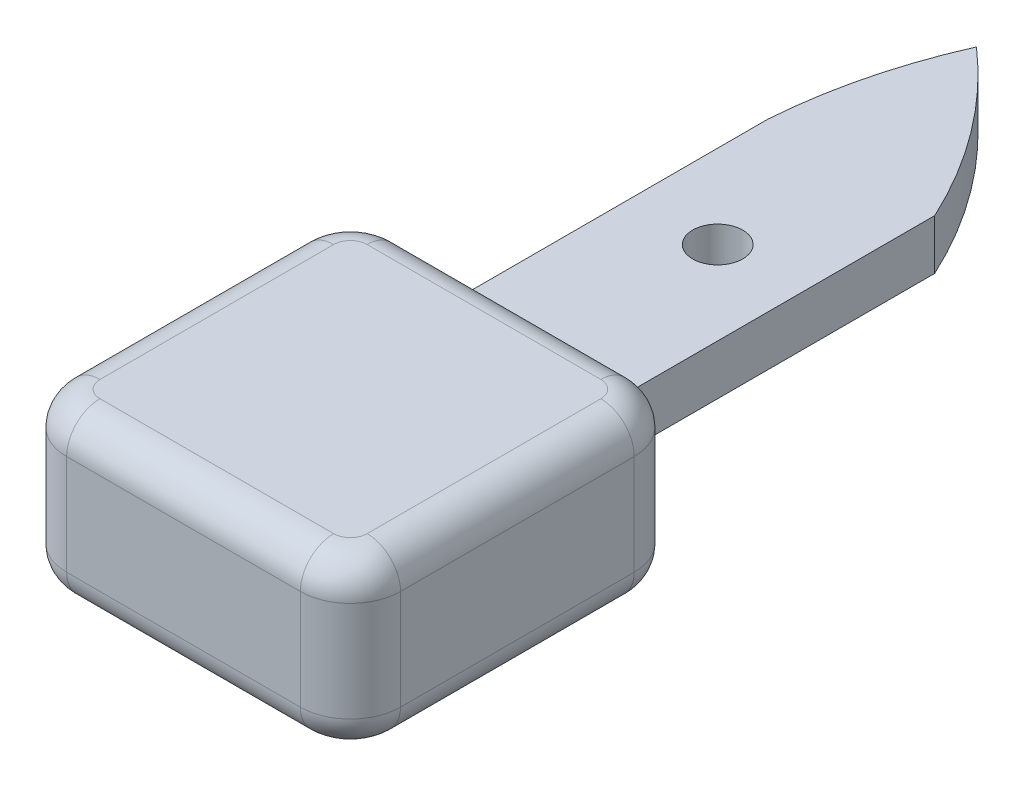
ISO-10303-21;
HEADER;
FILE_DESCRIPTION(('STEP AP214'),'2;1');
FILE_NAME('part.step','',(''),(''),'','','');
FILE_SCHEMA(('AUTOMOTIVE_DESIGN { 1 0 10303 214 1 1 1 1 }'));
ENDSEC;
DATA;
#1=APPLICATION_CONTEXT('core data for automotive mechanical design processes');
#2=APPLICATION_PROTOCOL_DEFINITION('international standard','automotive_design',2000,#1);
#3=PRODUCT_CONTEXT('',#1,'mechanical');
#4=PRODUCT('Part','Part','',(#3));
#5=PRODUCT_RELATED_PRODUCT_CATEGORY('part','',(#4));
#6=PRODUCT_DEFINITION_FORMATION('','',#4);
#7=PRODUCT_DEFINITION_CONTEXT('part definition',#1,'design');
#8=PRODUCT_DEFINITION('design','',#6,#7);
#9=PRODUCT_DEFINITION_SHAPE('','',#8);
#10=(LENGTH_UNIT() NAMED_UNIT(*) SI_UNIT(.MILLI.,.METRE.));
#11=(NAMED_UNIT(*) PLANE_ANGLE_UNIT() SI_UNIT($,.RADIAN.));
#12=(NAMED_UNIT(*) SI_UNIT($,.STERADIAN.) SOLID_ANGLE_UNIT());
#13=UNCERTAINTY_MEASURE_WITH_UNIT(LENGTH_MEASURE(1.E-05),#10,'distance_accuracy_value','');
#14=(GEOMETRIC_REPRESENTATION_CONTEXT(3) GLOBAL_UNCERTAINTY_ASSIGNED_CONTEXT((#13)) GLOBAL_UNIT_ASSIGNED_CONTEXT((#10,
#11,#12)) REPRESENTATION_CONTEXT('',''));
#15=CARTESIAN_POINT('',(0.,0.,0.));
#16=DIRECTION('',(0.,0.,1.));
#17=DIRECTION('',(1.,0.,0.));
#18=AXIS2_PLACEMENT_3D('',#15,#16,#17);
#19=CARTESIAN_POINT('',(-2.,3.,3.));
#20=DIRECTION('',(0.,1.,0.));
#21=DIRECTION('',(0.,0.,1.));
#22=AXIS2_PLACEMENT_3D('',#19,#20,#21);
#23=PLANE('',#22);
#24=CARTESIAN_POINT('',(5.,3.,-12.));
#25=DIRECTION('',(0.,1.,0.));
#26=DIRECTION('',(0.,0.,1.));
#27=AXIS2_PLACEMENT_3D('',#24,#25,#26);
#28=CIRCLE('',#27,1.5);
#29=CARTESIAN_POINT('',(5.,3.,-10.5));
#30=VERTEX_POINT('',#29);
#31=EDGE_CURVE('E731',#30,#30,#28,.T.);
#32=ORIENTED_EDGE('',*,*,#31,.F.);
#33=EDGE_LOOP('',(#32));
#34=FACE_BOUND('',#33,.T.);
#35=DIRECTION('',(0.,0.,1.));
#36=VECTOR('',#35,1.);
#37=CARTESIAN_POINT('',(0.,3.,0.));
#38=LINE('',#37,#36);
#39=CARTESIAN_POINT('',(0.,3.,-20.));
#40=VERTEX_POINT('',#39);
#41=CARTESIAN_POINT('',(0.,3.,0.));
#42=VERTEX_POINT('',#41);
#43=EDGE_CURVE('E205',#40,#42,#38,.T.);
#44=ORIENTED_EDGE('',*,*,#43,.T.);
#45=DIRECTION('',(1.,0.,0.));
#46=VECTOR('',#45,1.);
#47=CARTESIAN_POINT('',(-2.,3.,0.));
#48=LINE('',#47,#46);
#49=CARTESIAN_POINT('',(10.,3.,0.));
#50=VERTEX_POINT('',#49);
#51=EDGE_CURVE('E188',#42,#50,#48,.T.);
#52=ORIENTED_EDGE('',*,*,#51,.T.);
#53=DIRECTION('',(0.,0.,-1.));
#54=VECTOR('',#53,1.);
#55=CARTESIAN_POINT('',(10.,3.,-20.));
#56=LINE('',#55,#54);
#57=CARTESIAN_POINT('',(9.99999999999999,3.,-20.));
#58=VERTEX_POINT('',#57);
#59=EDGE_CURVE('E200',#50,#58,#56,.T.);
#60=ORIENTED_EDGE('',*,*,#59,.T.);
#61=CARTESIAN_POINT('',(-17.223389188611,3.,-7.39495810854175));
#62=DIRECTION('',(0.,1.,0.));
#63=DIRECTION('',(0.,0.,-1.));
#64=AXIS2_PLACEMENT_3D('',#61,#62,#63);
#65=CIRCLE('',#64,30.);
#66=CARTESIAN_POINT('',(2.49999999999999,3.,-30.));
#67=VERTEX_POINT('',#66);
#68=EDGE_CURVE('E740',#58,#67,#65,.T.);
#69=ORIENTED_EDGE('',*,*,#68,.T.);
#70=CARTESIAN_POINT('',(29.9215682084083,3.,-17.8321079478979));
#71=DIRECTION('',(0.,1.,0.));
#72=DIRECTION('',(0.,0.,-1.));
#73=AXIS2_PLACEMENT_3D('',#70,#71,#72);
#74=CIRCLE('',#73,30.);
#75=EDGE_CURVE('E209',#67,#40,#74,.T.);
#76=ORIENTED_EDGE('',*,*,#75,.T.);
#77=EDGE_LOOP('',(#44,#52,#60,#69,#76));
#78=FACE_BOUND('',#77,.T.);
#79=ADVANCED_FACE('F34',(#34,#78),#23,.T.);
#80=CARTESIAN_POINT('',(-2.,0.,3.));
#81=DIRECTION('',(0.,1.,0.));
#82=DIRECTION('',(0.,0.,1.));
#83=AXIS2_PLACEMENT_3D('',#80,#81,#82);
#84=PLANE('',#83);
#85=CARTESIAN_POINT('',(5.,0.,-12.));
#86=DIRECTION('',(0.,1.,0.));
#87=DIRECTION('',(0.,0.,1.));
#88=AXIS2_PLACEMENT_3D('',#85,#86,#87);
#89=CIRCLE('',#88,1.5);
#90=CARTESIAN_POINT('',(5.,0.,-10.5));
#91=VERTEX_POINT('',#90);
#92=EDGE_CURVE('E734',#91,#91,#89,.T.);
#93=ORIENTED_EDGE('',*,*,#92,.T.);
#94=EDGE_LOOP('',(#93));
#95=FACE_BOUND('',#94,.T.);
#96=DIRECTION('',(1.,0.,0.));
#97=VECTOR('',#96,1.);
#98=CARTESIAN_POINT('',(-2.,0.,0.));
#99=LINE('',#98,#97);
#100=CARTESIAN_POINT('',(0.,0.,0.));
#101=VERTEX_POINT('',#100);
#102=CARTESIAN_POINT('',(10.,0.,0.));
#103=VERTEX_POINT('',#102);
#104=EDGE_CURVE('E177',#101,#103,#99,.T.);
#105=ORIENTED_EDGE('',*,*,#104,.F.);
#106=DIRECTION('',(0.,0.,1.));
#107=VECTOR('',#106,1.);
#108=CARTESIAN_POINT('',(0.,0.,0.));
#109=LINE('',#108,#107);
#110=CARTESIAN_POINT('',(0.,0.,-20.));
#111=VERTEX_POINT('',#110);
#112=EDGE_CURVE('E181',#111,#101,#109,.T.);
#113=ORIENTED_EDGE('',*,*,#112,.F.);
#114=CARTESIAN_POINT('',(29.9215682084083,0.,-17.8321079478979));
#115=DIRECTION('',(0.,1.,0.));
#116=DIRECTION('',(0.,0.,-1.));
#117=AXIS2_PLACEMENT_3D('',#114,#115,#116);
#118=CIRCLE('',#117,30.);
#119=CARTESIAN_POINT('',(2.49999999999999,0.,-30.));
#120=VERTEX_POINT('',#119);
#121=EDGE_CURVE('E201',#120,#111,#118,.T.);
#122=ORIENTED_EDGE('',*,*,#121,.F.);
#123=CARTESIAN_POINT('',(-17.223389188611,0.,-7.39495810854175));
#124=DIRECTION('',(0.,1.,0.));
#125=DIRECTION('',(0.,0.,-1.));
#126=AXIS2_PLACEMENT_3D('',#123,#124,#125);
#127=CIRCLE('',#126,30.);
#128=CARTESIAN_POINT('',(9.99999999999999,0.,-20.));
#129=VERTEX_POINT('',#128);
#130=EDGE_CURVE('E744',#129,#120,#127,.T.);
#131=ORIENTED_EDGE('',*,*,#130,.F.);
#132=DIRECTION('',(0.,0.,-1.));
#133=VECTOR('',#132,1.);
#134=CARTESIAN_POINT('',(10.,0.,-20.));
#135=LINE('',#134,#133);
#136=EDGE_CURVE('E183',#103,#129,#135,.T.);
#137=ORIENTED_EDGE('',*,*,#136,.F.);
#138=EDGE_LOOP('',(#105,#113,#122,#131,#137));
#139=FACE_BOUND('',#138,.T.);
#140=ADVANCED_FACE('F179',(#95,#139),#84,.F.);
#141=CARTESIAN_POINT('',(-2.,3.,3.));
#142=DIRECTION('',(0.,-1.,0.));
#143=DIRECTION('',(0.,0.,-1.));
#144=AXIS2_PLACEMENT_3D('',#141,#142,#143);
#145=CYLINDRICAL_SURFACE('',#144,3.);
#146=DIRECTION('',(0.,-1.,0.));
#147=VECTOR('',#146,1.);
#148=CARTESIAN_POINT('',(-1.99999999999998,3.,0.));
#149=LINE('',#148,#147);
#150=CARTESIAN_POINT('',(-1.99999999999998,4.5,0.));
#151=VERTEX_POINT('',#150);
#152=CARTESIAN_POINT('',(-1.99999999999998,-1.5,0.));
#153=VERTEX_POINT('',#152);
#154=EDGE_CURVE('E241',#151,#153,#149,.T.);
#155=ORIENTED_EDGE('',*,*,#154,.T.);
#156=CARTESIAN_POINT('',(-2.,-1.5,3.));
#157=DIRECTION('',(0.,1.,0.));
#158=DIRECTION('',(0.,0.,1.));
#159=AXIS2_PLACEMENT_3D('',#156,#157,#158);
#160=CIRCLE('',#159,3.);
#161=CARTESIAN_POINT('',(-5.,-1.5,3.00000000000002));
#162=VERTEX_POINT('',#161);
#163=EDGE_CURVE('E247',#153,#162,#160,.T.);
#164=ORIENTED_EDGE('',*,*,#163,.T.);
#165=DIRECTION('',(0.,-1.,0.));
#166=VECTOR('',#165,1.);
#167=CARTESIAN_POINT('',(-5.,3.,3.00000000000002));
#168=LINE('',#167,#166);
#169=CARTESIAN_POINT('',(-5.,4.5,3.00000000000002));
#170=VERTEX_POINT('',#169);
#171=EDGE_CURVE('E238',#170,#162,#168,.T.);
#172=ORIENTED_EDGE('',*,*,#171,.F.);
#173=CARTESIAN_POINT('',(-2.,4.5,3.));
#174=DIRECTION('',(0.,1.,0.));
#175=DIRECTION('',(0.,0.,1.));
#176=AXIS2_PLACEMENT_3D('',#173,#174,#175);
#177=CIRCLE('',#176,3.);
#178=EDGE_CURVE('E244',#170,#151,#177,.F.);
#179=ORIENTED_EDGE('',*,*,#178,.T.);
#180=EDGE_LOOP('',(#155,#164,#172,#179));
#181=FACE_BOUND('',#180,.T.);
#182=ADVANCED_FACE('F410',(#181),#145,.T.);
#183=CARTESIAN_POINT('',(-5.,3.,3.00000000000002));
#184=DIRECTION('',(1.,0.,0.));
#185=DIRECTION('',(0.,0.,-1.));
#186=AXIS2_PLACEMENT_3D('',#183,#184,#185);
#187=PLANE('',#186);
#188=ORIENTED_EDGE('',*,*,#171,.T.);
#189=DIRECTION('',(0.,0.,1.));
#190=VECTOR('',#189,1.);
#191=CARTESIAN_POINT('',(-5.,-1.5,3.00000000000002));
#192=LINE('',#191,#190);
#193=CARTESIAN_POINT('',(-5.,-1.5,17.));
#194=VERTEX_POINT('',#193);
#195=EDGE_CURVE('E11',#162,#194,#192,.T.);
#196=ORIENTED_EDGE('',*,*,#195,.T.);
#197=DIRECTION('',(0.,-1.,0.));
#198=VECTOR('',#197,1.);
#199=CARTESIAN_POINT('',(-5.,3.,17.));
#200=LINE('',#199,#198);
#201=CARTESIAN_POINT('',(-5.,4.5,17.));
#202=VERTEX_POINT('',#201);
#203=EDGE_CURVE('E235',#202,#194,#200,.T.);
#204=ORIENTED_EDGE('',*,*,#203,.F.);
#205=DIRECTION('',(0.,0.,1.));
#206=VECTOR('',#205,1.);
#207=CARTESIAN_POINT('',(-5.,4.5,3.00000000000002));
#208=LINE('',#207,#206);
#209=EDGE_CURVE('E43',#202,#170,#208,.F.);
#210=ORIENTED_EDGE('',*,*,#209,.T.);
#211=EDGE_LOOP('',(#188,#196,#204,#210));
#212=FACE_BOUND('',#211,.T.);
#213=ADVANCED_FACE('F483',(#212),#187,.F.);
#214=CARTESIAN_POINT('',(-2.,3.,17.));
#215=DIRECTION('',(0.,-1.,0.));
#216=DIRECTION('',(0.,0.,-1.));
#217=AXIS2_PLACEMENT_3D('',#214,#215,#216);
#218=CYLINDRICAL_SURFACE('',#217,3.);
#219=ORIENTED_EDGE('',*,*,#203,.T.);
#220=CARTESIAN_POINT('',(-2.,-1.5,17.));
#221=DIRECTION('',(0.,1.,0.));
#222=DIRECTION('',(0.,0.,1.));
#223=AXIS2_PLACEMENT_3D('',#220,#221,#222);
#224=CIRCLE('',#223,3.);
#225=CARTESIAN_POINT('',(-2.,-1.5,20.));
#226=VERTEX_POINT('',#225);
#227=EDGE_CURVE('E285',#194,#226,#224,.T.);
#228=ORIENTED_EDGE('',*,*,#227,.T.);
#229=DIRECTION('',(0.,-1.,0.));
#230=VECTOR('',#229,1.);
#231=CARTESIAN_POINT('',(-2.,3.,20.));
#232=LINE('',#231,#230);
#233=CARTESIAN_POINT('',(-2.,4.5,20.));
#234=VERTEX_POINT('',#233);
#235=EDGE_CURVE('E232',#234,#226,#232,.T.);
#236=ORIENTED_EDGE('',*,*,#235,.F.);
#237=CARTESIAN_POINT('',(-2.,4.5,17.));
#238=DIRECTION('',(0.,1.,0.));
#239=DIRECTION('',(0.,0.,1.));
#240=AXIS2_PLACEMENT_3D('',#237,#238,#239);
#241=CIRCLE('',#240,3.);
#242=EDGE_CURVE('E283',#234,#202,#241,.F.);
#243=ORIENTED_EDGE('',*,*,#242,.T.);
#244=EDGE_LOOP('',(#219,#228,#236,#243));
#245=FACE_BOUND('',#244,.T.);
#246=ADVANCED_FACE('F480',(#245),#218,.T.);
#247=CARTESIAN_POINT('',(-2.,3.,20.));
#248=DIRECTION('',(0.,0.,-1.));
#249=DIRECTION('',(-1.,0.,0.));
#250=AXIS2_PLACEMENT_3D('',#247,#248,#249);
#251=PLANE('',#250);
#252=DIRECTION('',(0.,-1.,0.));
#253=VECTOR('',#252,1.);
#254=CARTESIAN_POINT('',(12.,3.,20.));
#255=LINE('',#254,#253);
#256=CARTESIAN_POINT('',(12.,4.5,20.));
#257=VERTEX_POINT('',#256);
#258=CARTESIAN_POINT('',(12.,-1.5,20.));
#259=VERTEX_POINT('',#258);
#260=EDGE_CURVE('E229',#257,#259,#255,.T.);
#261=ORIENTED_EDGE('',*,*,#260,.F.);
#262=DIRECTION('',(1.,0.,0.));
#263=VECTOR('',#262,1.);
#264=CARTESIAN_POINT('',(-2.,4.5,20.));
#265=LINE('',#264,#263);
#266=EDGE_CURVE('E304',#257,#234,#265,.F.);
#267=ORIENTED_EDGE('',*,*,#266,.T.);
#268=ORIENTED_EDGE('',*,*,#235,.T.);
#269=DIRECTION('',(1.,0.,0.));
#270=VECTOR('',#269,1.);
#271=CARTESIAN_POINT('',(-2.,-1.5,20.));
#272=LINE('',#271,#270);
#273=EDGE_CURVE('E302',#226,#259,#272,.T.);
#274=ORIENTED_EDGE('',*,*,#273,.T.);
#275=EDGE_LOOP('',(#261,#267,#268,#274));
#276=FACE_BOUND('',#275,.T.);
#277=ADVANCED_FACE('F363',(#276),#251,.F.);
#278=CARTESIAN_POINT('',(12.,3.,17.));
#279=DIRECTION('',(0.,-1.,0.));
#280=DIRECTION('',(0.,0.,-1.));
#281=AXIS2_PLACEMENT_3D('',#278,#279,#280);
#282=CYLINDRICAL_SURFACE('',#281,3.);
#283=ORIENTED_EDGE('',*,*,#260,.T.);
#284=CARTESIAN_POINT('',(12.,-1.5,17.));
#285=DIRECTION('',(0.,1.,0.));
#286=DIRECTION('',(0.,0.,1.));
#287=AXIS2_PLACEMENT_3D('',#284,#285,#286);
#288=CIRCLE('',#287,3.);
#289=CARTESIAN_POINT('',(15.,-1.5,17.));
#290=VERTEX_POINT('',#289);
#291=EDGE_CURVE('E281',#259,#290,#288,.T.);
#292=ORIENTED_EDGE('',*,*,#291,.T.);
#293=DIRECTION('',(0.,-1.,0.));
#294=VECTOR('',#293,1.);
#295=CARTESIAN_POINT('',(15.,3.,17.));
#296=LINE('',#295,#294);
#297=CARTESIAN_POINT('',(15.,4.5,17.));
#298=VERTEX_POINT('',#297);
#299=EDGE_CURVE('E226',#298,#290,#296,.T.);
#300=ORIENTED_EDGE('',*,*,#299,.F.);
#301=CARTESIAN_POINT('',(12.,4.5,17.));
#302=DIRECTION('',(0.,1.,0.));
#303=DIRECTION('',(0.,0.,1.));
#304=AXIS2_PLACEMENT_3D('',#301,#302,#303);
#305=CIRCLE('',#304,3.);
#306=EDGE_CURVE('E279',#298,#257,#305,.F.);
#307=ORIENTED_EDGE('',*,*,#306,.T.);
#308=EDGE_LOOP('',(#283,#292,#300,#307));
#309=FACE_BOUND('',#308,.T.);
#310=ADVANCED_FACE('F360',(#309),#282,.T.);
#311=CARTESIAN_POINT('',(15.,3.,17.));
#312=DIRECTION('',(-1.,0.,0.));
#313=DIRECTION('',(0.,0.,1.));
#314=AXIS2_PLACEMENT_3D('',#311,#312,#313);
#315=PLANE('',#314);
#316=ORIENTED_EDGE('',*,*,#299,.T.);
#317=DIRECTION('',(0.,0.,-1.));
#318=VECTOR('',#317,1.);
#319=CARTESIAN_POINT('',(15.,-1.5,17.));
#320=LINE('',#319,#318);
#321=CARTESIAN_POINT('',(15.,-1.5,3.));
#322=VERTEX_POINT('',#321);
#323=EDGE_CURVE('E277',#290,#322,#320,.T.);
#324=ORIENTED_EDGE('',*,*,#323,.T.);
#325=DIRECTION('',(0.,-1.,0.));
#326=VECTOR('',#325,1.);
#327=CARTESIAN_POINT('',(15.,3.,3.));
#328=LINE('',#327,#326);
#329=CARTESIAN_POINT('',(15.,4.5,3.));
#330=VERTEX_POINT('',#329);
#331=EDGE_CURVE('E223',#330,#322,#328,.T.);
#332=ORIENTED_EDGE('',*,*,#331,.F.);
#333=DIRECTION('',(0.,0.,-1.));
#334=VECTOR('',#333,1.);
#335=CARTESIAN_POINT('',(15.,4.5,17.));
#336=LINE('',#335,#334);
#337=EDGE_CURVE('E275',#330,#298,#336,.F.);
#338=ORIENTED_EDGE('',*,*,#337,.T.);
#339=EDGE_LOOP('',(#316,#324,#332,#338));
#340=FACE_BOUND('',#339,.T.);
#341=ADVANCED_FACE('F387',(#340),#315,.F.);
#342=CARTESIAN_POINT('',(12.,3.,3.));
#343=DIRECTION('',(0.,-1.,0.));
#344=DIRECTION('',(0.,0.,-1.));
#345=AXIS2_PLACEMENT_3D('',#342,#343,#344);
#346=CYLINDRICAL_SURFACE('',#345,3.);
#347=ORIENTED_EDGE('',*,*,#331,.T.);
#348=CARTESIAN_POINT('',(12.,-1.5,3.));
#349=DIRECTION('',(0.,1.,0.));
#350=DIRECTION('',(0.,0.,1.));
#351=AXIS2_PLACEMENT_3D('',#348,#349,#350);
#352=CIRCLE('',#351,3.);
#353=CARTESIAN_POINT('',(12.,-1.5,0.));
#354=VERTEX_POINT('',#353);
#355=EDGE_CURVE('E273',#322,#354,#352,.T.);
#356=ORIENTED_EDGE('',*,*,#355,.T.);
#357=DIRECTION('',(0.,-1.,0.));
#358=VECTOR('',#357,1.);
#359=CARTESIAN_POINT('',(12.,3.,0.));
#360=LINE('',#359,#358);
#361=CARTESIAN_POINT('',(12.,4.5,0.));
#362=VERTEX_POINT('',#361);
#363=EDGE_CURVE('E220',#362,#354,#360,.T.);
#364=ORIENTED_EDGE('',*,*,#363,.F.);
#365=CARTESIAN_POINT('',(12.,4.5,3.));
#366=DIRECTION('',(0.,1.,0.));
#367=DIRECTION('',(0.,0.,1.));
#368=AXIS2_PLACEMENT_3D('',#365,#366,#367);
#369=CIRCLE('',#368,3.);
#370=EDGE_CURVE('E271',#362,#330,#369,.F.);
#371=ORIENTED_EDGE('',*,*,#370,.T.);
#372=EDGE_LOOP('',(#347,#356,#364,#371));
#373=FACE_BOUND('',#372,.T.);
#374=ADVANCED_FACE('F391',(#373),#346,.T.);
#375=CARTESIAN_POINT('',(12.,3.,0.));
#376=DIRECTION('',(0.,0.,1.));
#377=DIRECTION('',(1.,0.,0.));
#378=AXIS2_PLACEMENT_3D('',#375,#376,#377);
#379=PLANE('',#378);
#380=ORIENTED_EDGE('',*,*,#363,.T.);
#381=DIRECTION('',(-1.,0.,0.));
#382=VECTOR('',#381,1.);
#383=CARTESIAN_POINT('',(12.,-1.5,0.));
#384=LINE('',#383,#382);
#385=EDGE_CURVE('E269',#354,#153,#384,.T.);
#386=ORIENTED_EDGE('',*,*,#385,.T.);
#387=ORIENTED_EDGE('',*,*,#154,.F.);
#388=DIRECTION('',(-1.,0.,0.));
#389=VECTOR('',#388,1.);
#390=CARTESIAN_POINT('',(12.,4.5,0.));
#391=LINE('',#390,#389);
#392=EDGE_CURVE('E267',#151,#362,#391,.F.);
#393=ORIENTED_EDGE('',*,*,#392,.T.);
#394=EDGE_LOOP('',(#380,#386,#387,#393));
#395=FACE_BOUND('',#394,.T.);
#396=ORIENTED_EDGE('',*,*,#51,.F.);
#397=DIRECTION('',(0.,-1.,0.));
#398=VECTOR('',#397,1.);
#399=CARTESIAN_POINT('',(0.,3.,0.));
#400=LINE('',#399,#398);
#401=EDGE_CURVE('E196',#42,#101,#400,.T.);
#402=ORIENTED_EDGE('',*,*,#401,.T.);
#403=ORIENTED_EDGE('',*,*,#104,.T.);
#404=DIRECTION('',(0.,-1.,0.));
#405=VECTOR('',#404,1.);
#406=CARTESIAN_POINT('',(10.,3.,0.));
#407=LINE('',#406,#405);
#408=EDGE_CURVE('E218',#50,#103,#407,.T.);
#409=ORIENTED_EDGE('',*,*,#408,.F.);
#410=EDGE_LOOP('',(#396,#402,#403,#409));
#411=FACE_BOUND('',#410,.T.);
#412=ADVANCED_FACE('F203',(#395,#411),#379,.F.);
#413=CARTESIAN_POINT('',(10.,3.,-20.));
#414=DIRECTION('',(-1.,0.,0.));
#415=DIRECTION('',(0.,0.,1.));
#416=AXIS2_PLACEMENT_3D('',#413,#414,#415);
#417=PLANE('',#416);
#418=ORIENTED_EDGE('',*,*,#136,.T.);
#419=DIRECTION('',(0.,-1.,0.));
#420=VECTOR('',#419,1.);
#421=CARTESIAN_POINT('',(9.99999999999999,3.,-20.));
#422=LINE('',#421,#420);
#423=EDGE_CURVE('E215',#58,#129,#422,.T.);
#424=ORIENTED_EDGE('',*,*,#423,.F.);
#425=ORIENTED_EDGE('',*,*,#59,.F.);
#426=ORIENTED_EDGE('',*,*,#408,.T.);
#427=EDGE_LOOP('',(#418,#424,#425,#426));
#428=FACE_BOUND('',#427,.T.);
#429=ADVANCED_FACE('F465',(#428),#417,.F.);
#430=CARTESIAN_POINT('',(-17.223389188611,3.,-7.39495810854175));
#431=DIRECTION('',(0.,-1.,0.));
#432=DIRECTION('',(0.,0.,-1.));
#433=AXIS2_PLACEMENT_3D('',#430,#431,#432);
#434=CYLINDRICAL_SURFACE('',#433,30.);
#435=ORIENTED_EDGE('',*,*,#130,.T.);
#436=DIRECTION('',(0.,-1.,0.));
#437=VECTOR('',#436,1.);
#438=CARTESIAN_POINT('',(2.49999999999999,3.,-30.));
#439=LINE('',#438,#437);
#440=EDGE_CURVE('E207',#67,#120,#439,.T.);
#441=ORIENTED_EDGE('',*,*,#440,.F.);
#442=ORIENTED_EDGE('',*,*,#68,.F.);
#443=ORIENTED_EDGE('',*,*,#423,.T.);
#444=EDGE_LOOP('',(#435,#441,#442,#443));
#445=FACE_BOUND('',#444,.T.);
#446=ADVANCED_FACE('F461',(#445),#434,.T.);
#447=CARTESIAN_POINT('',(29.9215682084083,3.,-17.8321079478979));
#448=DIRECTION('',(0.,-1.,0.));
#449=DIRECTION('',(0.,0.,-1.));
#450=AXIS2_PLACEMENT_3D('',#447,#448,#449);
#451=CYLINDRICAL_SURFACE('',#450,30.);
#452=ORIENTED_EDGE('',*,*,#121,.T.);
#453=DIRECTION('',(0.,-1.,0.));
#454=VECTOR('',#453,1.);
#455=CARTESIAN_POINT('',(0.,3.,-20.));
#456=LINE('',#455,#454);
#457=EDGE_CURVE('E199',#40,#111,#456,.T.);
#458=ORIENTED_EDGE('',*,*,#457,.F.);
#459=ORIENTED_EDGE('',*,*,#75,.F.);
#460=ORIENTED_EDGE('',*,*,#440,.T.);
#461=EDGE_LOOP('',(#452,#458,#459,#460));
#462=FACE_BOUND('',#461,.T.);
#463=ADVANCED_FACE('F458',(#462),#451,.T.);
#464=CARTESIAN_POINT('',(0.,3.,0.));
#465=DIRECTION('',(1.,0.,0.));
#466=DIRECTION('',(0.,0.,-1.));
#467=AXIS2_PLACEMENT_3D('',#464,#465,#466);
#468=PLANE('',#467);
#469=ORIENTED_EDGE('',*,*,#112,.T.);
#470=ORIENTED_EDGE('',*,*,#401,.F.);
#471=ORIENTED_EDGE('',*,*,#43,.F.);
#472=ORIENTED_EDGE('',*,*,#457,.T.);
#473=EDGE_LOOP('',(#469,#470,#471,#472));
#474=FACE_BOUND('',#473,.T.);
#475=ADVANCED_FACE('F194',(#474),#468,.F.);
#476=CARTESIAN_POINT('',(5.,3.,-12.));
#477=DIRECTION('',(0.,-1.,0.));
#478=DIRECTION('',(0.,0.,-1.));
#479=AXIS2_PLACEMENT_3D('',#476,#477,#478);
#480=CYLINDRICAL_SURFACE('',#479,1.5);
#481=ORIENTED_EDGE('',*,*,#31,.T.);
#482=EDGE_LOOP('',(#481));
#483=FACE_BOUND('',#482,.T.);
#484=ORIENTED_EDGE('',*,*,#92,.F.);
#485=EDGE_LOOP('',(#484));
#486=FACE_BOUND('',#485,.T.);
#487=ADVANCED_FACE('F453',(#483,#486),#480,.F.);
#488=CARTESIAN_POINT('',(12.,-3.5,3.));
#489=DIRECTION('',(0.,1.,0.));
#490=DIRECTION('',(0.,0.,1.));
#491=AXIS2_PLACEMENT_3D('',#488,#489,#490);
#492=PLANE('',#491);
#493=CARTESIAN_POINT('',(-2.,-3.5,3.));
#494=DIRECTION('',(0.,1.,0.));
#495=DIRECTION('',(0.,0.,1.));
#496=AXIS2_PLACEMENT_3D('',#493,#494,#495);
#497=CIRCLE('',#496,1.);
#498=CARTESIAN_POINT('',(-3.,-3.5,3.00000000000001));
#499=VERTEX_POINT('',#498);
#500=CARTESIAN_POINT('',(-1.99999999999999,-3.5,2.));
#501=VERTEX_POINT('',#500);
#502=EDGE_CURVE('E254',#499,#501,#497,.F.);
#503=ORIENTED_EDGE('',*,*,#502,.T.);
#504=DIRECTION('',(-1.,0.,0.));
#505=VECTOR('',#504,1.);
#506=CARTESIAN_POINT('',(12.,-3.5,2.));
#507=LINE('',#506,#505);
#508=CARTESIAN_POINT('',(12.,-3.5,2.));
#509=VERTEX_POINT('',#508);
#510=EDGE_CURVE('E265',#501,#509,#507,.F.);
#511=ORIENTED_EDGE('',*,*,#510,.T.);
#512=CARTESIAN_POINT('',(12.,-3.5,3.));
#513=DIRECTION('',(0.,1.,0.));
#514=DIRECTION('',(0.,0.,1.));
#515=AXIS2_PLACEMENT_3D('',#512,#513,#514);
#516=CIRCLE('',#515,1.);
#517=CARTESIAN_POINT('',(13.,-3.5,3.));
#518=VERTEX_POINT('',#517);
#519=EDGE_CURVE('E263',#509,#518,#516,.F.);
#520=ORIENTED_EDGE('',*,*,#519,.T.);
#521=DIRECTION('',(0.,0.,-1.));
#522=VECTOR('',#521,1.);
#523=CARTESIAN_POINT('',(13.,-3.5,3.));
#524=LINE('',#523,#522);
#525=CARTESIAN_POINT('',(13.,-3.5,17.));
#526=VERTEX_POINT('',#525);
#527=EDGE_CURVE('E261',#518,#526,#524,.F.);
#528=ORIENTED_EDGE('',*,*,#527,.T.);
#529=CARTESIAN_POINT('',(12.,-3.5,17.));
#530=DIRECTION('',(0.,1.,0.));
#531=DIRECTION('',(0.,0.,1.));
#532=AXIS2_PLACEMENT_3D('',#529,#530,#531);
#533=CIRCLE('',#532,0.999999999999999);
#534=CARTESIAN_POINT('',(12.,-3.5,18.));
#535=VERTEX_POINT('',#534);
#536=EDGE_CURVE('E259',#526,#535,#533,.F.);
#537=ORIENTED_EDGE('',*,*,#536,.T.);
#538=DIRECTION('',(1.,0.,0.));
#539=VECTOR('',#538,1.);
#540=CARTESIAN_POINT('',(12.,-3.5,18.));
#541=LINE('',#540,#539);
#542=CARTESIAN_POINT('',(-2.,-3.5,18.));
#543=VERTEX_POINT('',#542);
#544=EDGE_CURVE('E257',#535,#543,#541,.F.);
#545=ORIENTED_EDGE('',*,*,#544,.T.);
#546=CARTESIAN_POINT('',(-2.,-3.5,17.));
#547=DIRECTION('',(0.,1.,0.));
#548=DIRECTION('',(0.,0.,1.));
#549=AXIS2_PLACEMENT_3D('',#546,#547,#548);
#550=CIRCLE('',#549,1.);
#551=CARTESIAN_POINT('',(-3.,-3.5,17.));
#552=VERTEX_POINT('',#551);
#553=EDGE_CURVE('E252',#543,#552,#550,.F.);
#554=ORIENTED_EDGE('',*,*,#553,.T.);
#555=DIRECTION('',(0.,0.,1.));
#556=VECTOR('',#555,1.);
#557=CARTESIAN_POINT('',(-3.,-3.5,3.));
#558=LINE('',#557,#556);
#559=EDGE_CURVE('E250',#552,#499,#558,.F.);
#560=ORIENTED_EDGE('',*,*,#559,.T.);
#561=EDGE_LOOP('',(#503,#511,#520,#528,#537,#545,#554,#560));
#562=FACE_BOUND('',#561,.T.);
#563=ADVANCED_FACE('F378',(#562),#492,.F.);
#564=CARTESIAN_POINT('',(12.,6.5,3.));
#565=DIRECTION('',(0.,1.,0.));
#566=DIRECTION('',(0.,0.,1.));
#567=AXIS2_PLACEMENT_3D('',#564,#565,#566);
#568=PLANE('',#567);
#569=CARTESIAN_POINT('',(12.,6.5,3.));
#570=DIRECTION('',(0.,1.,0.));
#571=DIRECTION('',(0.,0.,1.));
#572=AXIS2_PLACEMENT_3D('',#569,#570,#571);
#573=CIRCLE('',#572,1.);
#574=CARTESIAN_POINT('',(13.,6.5,3.));
#575=VERTEX_POINT('',#574);
#576=CARTESIAN_POINT('',(12.,6.5,2.));
#577=VERTEX_POINT('',#576);
#578=EDGE_CURVE('E51',#575,#577,#573,.T.);
#579=ORIENTED_EDGE('',*,*,#578,.T.);
#580=DIRECTION('',(-1.,0.,0.));
#581=VECTOR('',#580,1.);
#582=CARTESIAN_POINT('',(-1.99999999999998,6.5,2.));
#583=LINE('',#582,#581);
#584=CARTESIAN_POINT('',(-1.99999999999999,6.5,2.));
#585=VERTEX_POINT('',#584);
#586=EDGE_CURVE('E300',#577,#585,#583,.T.);
#587=ORIENTED_EDGE('',*,*,#586,.T.);
#588=CARTESIAN_POINT('',(-2.,6.5,3.));
#589=DIRECTION('',(0.,1.,0.));
#590=DIRECTION('',(0.,0.,1.));
#591=AXIS2_PLACEMENT_3D('',#588,#589,#590);
#592=CIRCLE('',#591,1.);
#593=CARTESIAN_POINT('',(-3.,6.5,3.00000000000001));
#594=VERTEX_POINT('',#593);
#595=EDGE_CURVE('E291',#585,#594,#592,.T.);
#596=ORIENTED_EDGE('',*,*,#595,.T.);
#597=DIRECTION('',(0.,0.,1.));
#598=VECTOR('',#597,1.);
#599=CARTESIAN_POINT('',(-3.,6.5,17.));
#600=LINE('',#599,#598);
#601=CARTESIAN_POINT('',(-3.,6.5,17.));
#602=VERTEX_POINT('',#601);
#603=EDGE_CURVE('E287',#594,#602,#600,.T.);
#604=ORIENTED_EDGE('',*,*,#603,.T.);
#605=CARTESIAN_POINT('',(-2.,6.5,17.));
#606=DIRECTION('',(0.,1.,0.));
#607=DIRECTION('',(0.,0.,1.));
#608=AXIS2_PLACEMENT_3D('',#605,#606,#607);
#609=CIRCLE('',#608,1.);
#610=CARTESIAN_POINT('',(-2.,6.5,18.));
#611=VERTEX_POINT('',#610);
#612=EDGE_CURVE('E289',#602,#611,#609,.T.);
#613=ORIENTED_EDGE('',*,*,#612,.T.);
#614=DIRECTION('',(1.,0.,0.));
#615=VECTOR('',#614,1.);
#616=CARTESIAN_POINT('',(12.,6.5,18.));
#617=LINE('',#616,#615);
#618=CARTESIAN_POINT('',(12.,6.5,18.));
#619=VERTEX_POINT('',#618);
#620=EDGE_CURVE('E294',#611,#619,#617,.T.);
#621=ORIENTED_EDGE('',*,*,#620,.T.);
#622=CARTESIAN_POINT('',(12.,6.5,17.));
#623=DIRECTION('',(0.,1.,0.));
#624=DIRECTION('',(0.,0.,1.));
#625=AXIS2_PLACEMENT_3D('',#622,#623,#624);
#626=CIRCLE('',#625,0.999999999999999);
#627=CARTESIAN_POINT('',(13.,6.5,17.));
#628=VERTEX_POINT('',#627);
#629=EDGE_CURVE('E296',#619,#628,#626,.T.);
#630=ORIENTED_EDGE('',*,*,#629,.T.);
#631=DIRECTION('',(0.,0.,-1.));
#632=VECTOR('',#631,1.);
#633=CARTESIAN_POINT('',(13.,6.5,3.));
#634=LINE('',#633,#632);
#635=EDGE_CURVE('E56',#628,#575,#634,.T.);
#636=ORIENTED_EDGE('',*,*,#635,.T.);
#637=EDGE_LOOP('',(#579,#587,#596,#604,#613,#621,#630,#636));
#638=FACE_BOUND('',#637,.T.);
#639=ADVANCED_FACE('F425',(#638),#568,.T.);
#640=CARTESIAN_POINT('',(12.,-1.5,17.));
#641=DIRECTION('',(0.,1.,0.));
#642=DIRECTION('',(0.,0.,1.));
#643=AXIS2_PLACEMENT_3D('',#640,#641,#642);
#644=DEGENERATE_TOROIDAL_SURFACE('',#643,0.999999999999999,2.,.T.);
#645=CARTESIAN_POINT('',(12.,-1.5,18.));
#646=DIRECTION('',(-1.,0.,0.));
#647=DIRECTION('',(0.,0.,1.));
#648=AXIS2_PLACEMENT_3D('',#645,#646,#647);
#649=CIRCLE('',#648,2.);
#650=EDGE_CURVE('E323',#535,#259,#649,.T.);
#651=ORIENTED_EDGE('',*,*,#650,.F.);
#652=ORIENTED_EDGE('',*,*,#536,.F.);
#653=CARTESIAN_POINT('',(13.,-1.5,17.));
#654=DIRECTION('',(0.,0.,-1.));
#655=DIRECTION('',(-1.,0.,0.));
#656=AXIS2_PLACEMENT_3D('',#653,#654,#655);
#657=CIRCLE('',#656,2.);
#658=EDGE_CURVE('E189',#290,#526,#657,.T.);
#659=ORIENTED_EDGE('',*,*,#658,.F.);
#660=ORIENTED_EDGE('',*,*,#291,.F.);
#661=EDGE_LOOP('',(#651,#652,#659,#660));
#662=FACE_BOUND('',#661,.T.);
#663=ADVANCED_FACE('F384',(#662),#644,.T.);
#664=CARTESIAN_POINT('',(13.,-1.5,17.));
#665=DIRECTION('',(0.,0.,-1.));
#666=DIRECTION('',(-1.,0.,0.));
#667=AXIS2_PLACEMENT_3D('',#664,#665,#666);
#668=CYLINDRICAL_SURFACE('',#667,2.);
#669=ORIENTED_EDGE('',*,*,#658,.T.);
#670=ORIENTED_EDGE('',*,*,#527,.F.);
#671=CARTESIAN_POINT('',(13.,-1.5,3.));
#672=DIRECTION('',(0.,0.,-1.));
#673=DIRECTION('',(-1.,0.,0.));
#674=AXIS2_PLACEMENT_3D('',#671,#672,#673);
#675=CIRCLE('',#674,2.);
#676=EDGE_CURVE('E320',#322,#518,#675,.T.);
#677=ORIENTED_EDGE('',*,*,#676,.F.);
#678=ORIENTED_EDGE('',*,*,#323,.F.);
#679=EDGE_LOOP('',(#669,#670,#677,#678));
#680=FACE_BOUND('',#679,.T.);
#681=ADVANCED_FACE('F396',(#680),#668,.T.);
#682=CARTESIAN_POINT('',(-2.,-1.5,18.));
#683=DIRECTION('',(1.,0.,0.));
#684=DIRECTION('',(0.,0.,-1.));
#685=AXIS2_PLACEMENT_3D('',#682,#683,#684);
#686=CYLINDRICAL_SURFACE('',#685,2.);
#687=ORIENTED_EDGE('',*,*,#650,.T.);
#688=ORIENTED_EDGE('',*,*,#273,.F.);
#689=CARTESIAN_POINT('',(-2.,-1.5,18.));
#690=DIRECTION('',(-1.,0.,0.));
#691=DIRECTION('',(0.,0.,1.));
#692=AXIS2_PLACEMENT_3D('',#689,#690,#691);
#693=CIRCLE('',#692,2.);
#694=EDGE_CURVE('E317',#543,#226,#693,.T.);
#695=ORIENTED_EDGE('',*,*,#694,.F.);
#696=ORIENTED_EDGE('',*,*,#544,.F.);
#697=EDGE_LOOP('',(#687,#688,#695,#696));
#698=FACE_BOUND('',#697,.T.);
#699=ADVANCED_FACE('F368',(#698),#686,.T.);
#700=CARTESIAN_POINT('',(12.,-1.5,3.));
#701=DIRECTION('',(0.,1.,0.));
#702=DIRECTION('',(0.,0.,1.));
#703=AXIS2_PLACEMENT_3D('',#700,#701,#702);
#704=DEGENERATE_TOROIDAL_SURFACE('',#703,1.,2.,.T.);
#705=ORIENTED_EDGE('',*,*,#676,.T.);
#706=ORIENTED_EDGE('',*,*,#519,.F.);
#707=CARTESIAN_POINT('',(12.,-1.5,2.));
#708=DIRECTION('',(-1.,0.,0.));
#709=DIRECTION('',(0.,0.,1.));
#710=AXIS2_PLACEMENT_3D('',#707,#708,#709);
#711=CIRCLE('',#710,2.);
#712=EDGE_CURVE('E314',#354,#509,#711,.T.);
#713=ORIENTED_EDGE('',*,*,#712,.F.);
#714=ORIENTED_EDGE('',*,*,#355,.F.);
#715=EDGE_LOOP('',(#705,#706,#713,#714));
#716=FACE_BOUND('',#715,.T.);
#717=ADVANCED_FACE('F400',(#716),#704,.T.);
#718=CARTESIAN_POINT('',(-2.,-1.5,17.));
#719=DIRECTION('',(0.,1.,0.));
#720=DIRECTION('',(0.,0.,1.));
#721=AXIS2_PLACEMENT_3D('',#718,#719,#720);
#722=DEGENERATE_TOROIDAL_SURFACE('',#721,1.,2.,.T.);
#723=ORIENTED_EDGE('',*,*,#694,.T.);
#724=ORIENTED_EDGE('',*,*,#227,.F.);
#725=CARTESIAN_POINT('',(-3.,-1.5,17.));
#726=DIRECTION('',(0.,0.,-1.));
#727=DIRECTION('',(-1.,0.,0.));
#728=AXIS2_PLACEMENT_3D('',#725,#726,#727);
#729=CIRCLE('',#728,2.);
#730=EDGE_CURVE('E311',#552,#194,#729,.T.);
#731=ORIENTED_EDGE('',*,*,#730,.F.);
#732=ORIENTED_EDGE('',*,*,#553,.F.);
#733=EDGE_LOOP('',(#723,#724,#731,#732));
#734=FACE_BOUND('',#733,.T.);
#735=ADVANCED_FACE('F374',(#734),#722,.T.);
#736=CARTESIAN_POINT('',(12.,-1.5,2.));
#737=DIRECTION('',(-1.,0.,0.));
#738=DIRECTION('',(0.,0.,1.));
#739=AXIS2_PLACEMENT_3D('',#736,#737,#738);
#740=CYLINDRICAL_SURFACE('',#739,2.);
#741=ORIENTED_EDGE('',*,*,#712,.T.);
#742=ORIENTED_EDGE('',*,*,#510,.F.);
#743=CARTESIAN_POINT('',(-1.99999999999998,-1.5,2.));
#744=DIRECTION('',(-1.,0.,0.));
#745=DIRECTION('',(0.,-1.,0.));
#746=AXIS2_PLACEMENT_3D('',#743,#744,#745);
#747=CIRCLE('',#746,2.);
#748=EDGE_CURVE('E309',#153,#501,#747,.T.);
#749=ORIENTED_EDGE('',*,*,#748,.F.);
#750=ORIENTED_EDGE('',*,*,#385,.F.);
#751=EDGE_LOOP('',(#741,#742,#749,#750));
#752=FACE_BOUND('',#751,.T.);
#753=ADVANCED_FACE('F405',(#752),#740,.T.);
#754=CARTESIAN_POINT('',(-3.,-1.5,3.00000000000002));
#755=DIRECTION('',(0.,0.,1.));
#756=DIRECTION('',(1.,0.,0.));
#757=AXIS2_PLACEMENT_3D('',#754,#755,#756);
#758=CYLINDRICAL_SURFACE('',#757,2.);
#759=ORIENTED_EDGE('',*,*,#730,.T.);
#760=ORIENTED_EDGE('',*,*,#195,.F.);
#761=CARTESIAN_POINT('',(-3.,-1.5,3.00000000000001));
#762=DIRECTION('',(0.,0.,-1.));
#763=DIRECTION('',(-1.,0.,0.));
#764=AXIS2_PLACEMENT_3D('',#761,#762,#763);
#765=CIRCLE('',#764,2.);
#766=EDGE_CURVE('E307',#499,#162,#765,.T.);
#767=ORIENTED_EDGE('',*,*,#766,.F.);
#768=ORIENTED_EDGE('',*,*,#559,.F.);
#769=EDGE_LOOP('',(#759,#760,#767,#768));
#770=FACE_BOUND('',#769,.T.);
#771=ADVANCED_FACE('F493',(#770),#758,.T.);
#772=CARTESIAN_POINT('',(-2.,-1.5,3.));
#773=DIRECTION('',(0.,1.,0.));
#774=DIRECTION('',(0.,0.,1.));
#775=AXIS2_PLACEMENT_3D('',#772,#773,#774);
#776=DEGENERATE_TOROIDAL_SURFACE('',#775,1.,2.,.T.);
#777=ORIENTED_EDGE('',*,*,#748,.T.);
#778=ORIENTED_EDGE('',*,*,#502,.F.);
#779=ORIENTED_EDGE('',*,*,#766,.T.);
#780=ORIENTED_EDGE('',*,*,#163,.F.);
#781=EDGE_LOOP('',(#777,#778,#779,#780));
#782=FACE_BOUND('',#781,.T.);
#783=ADVANCED_FACE('F490',(#782),#776,.T.);
#784=CARTESIAN_POINT('',(12.,4.5,17.));
#785=DIRECTION('',(0.,1.,0.));
#786=DIRECTION('',(0.,0.,1.));
#787=AXIS2_PLACEMENT_3D('',#784,#785,#786);
#788=DEGENERATE_TOROIDAL_SURFACE('',#787,0.999999999999999,2.,.T.);
#789=CARTESIAN_POINT('',(12.,4.5,18.));
#790=DIRECTION('',(-1.,0.,0.));
#791=DIRECTION('',(0.,0.,1.));
#792=AXIS2_PLACEMENT_3D('',#789,#790,#791);
#793=CIRCLE('',#792,2.);
#794=EDGE_CURVE('E343',#257,#619,#793,.T.);
#795=ORIENTED_EDGE('',*,*,#794,.F.);
#796=ORIENTED_EDGE('',*,*,#306,.F.);
#797=CARTESIAN_POINT('',(13.,4.5,17.));
#798=DIRECTION('',(0.,0.,-1.));
#799=DIRECTION('',(-1.,0.,0.));
#800=AXIS2_PLACEMENT_3D('',#797,#798,#799);
#801=CIRCLE('',#800,2.);
#802=EDGE_CURVE('E38',#628,#298,#801,.T.);
#803=ORIENTED_EDGE('',*,*,#802,.F.);
#804=ORIENTED_EDGE('',*,*,#629,.F.);
#805=EDGE_LOOP('',(#795,#796,#803,#804));
#806=FACE_BOUND('',#805,.T.);
#807=ADVANCED_FACE('F36',(#806),#788,.T.);
#808=CARTESIAN_POINT('',(13.,4.5,3.));
#809=DIRECTION('',(0.,0.,1.));
#810=DIRECTION('',(1.,0.,0.));
#811=AXIS2_PLACEMENT_3D('',#808,#809,#810);
#812=CYLINDRICAL_SURFACE('',#811,2.);
#813=ORIENTED_EDGE('',*,*,#802,.T.);
#814=ORIENTED_EDGE('',*,*,#337,.F.);
#815=CARTESIAN_POINT('',(13.,4.5,3.));
#816=DIRECTION('',(0.,0.,-1.));
#817=DIRECTION('',(-1.,0.,0.));
#818=AXIS2_PLACEMENT_3D('',#815,#816,#817);
#819=CIRCLE('',#818,2.);
#820=EDGE_CURVE('E341',#575,#330,#819,.T.);
#821=ORIENTED_EDGE('',*,*,#820,.F.);
#822=ORIENTED_EDGE('',*,*,#635,.F.);
#823=EDGE_LOOP('',(#813,#814,#821,#822));
#824=FACE_BOUND('',#823,.T.);
#825=ADVANCED_FACE('F353',(#824),#812,.T.);
#826=CARTESIAN_POINT('',(12.,4.5,18.));
#827=DIRECTION('',(-1.,0.,0.));
#828=DIRECTION('',(0.,0.,1.));
#829=AXIS2_PLACEMENT_3D('',#826,#827,#828);
#830=CYLINDRICAL_SURFACE('',#829,2.);
#831=ORIENTED_EDGE('',*,*,#794,.T.);
#832=ORIENTED_EDGE('',*,*,#620,.F.);
#833=CARTESIAN_POINT('',(-2.,4.5,18.));
#834=DIRECTION('',(-1.,0.,0.));
#835=DIRECTION('',(0.,0.,1.));
#836=AXIS2_PLACEMENT_3D('',#833,#834,#835);
#837=CIRCLE('',#836,2.);
#838=EDGE_CURVE('E338',#234,#611,#837,.T.);
#839=ORIENTED_EDGE('',*,*,#838,.F.);
#840=ORIENTED_EDGE('',*,*,#266,.F.);
#841=EDGE_LOOP('',(#831,#832,#839,#840));
#842=FACE_BOUND('',#841,.T.);
#843=ADVANCED_FACE('F433',(#842),#830,.T.);
#844=CARTESIAN_POINT('',(12.,4.5,3.));
#845=DIRECTION('',(0.,1.,0.));
#846=DIRECTION('',(0.,0.,1.));
#847=AXIS2_PLACEMENT_3D('',#844,#845,#846);
#848=DEGENERATE_TOROIDAL_SURFACE('',#847,1.,2.,.T.);
#849=ORIENTED_EDGE('',*,*,#820,.T.);
#850=ORIENTED_EDGE('',*,*,#370,.F.);
#851=CARTESIAN_POINT('',(12.,4.5,2.));
#852=DIRECTION('',(-1.,0.,0.));
#853=DIRECTION('',(0.,0.,1.));
#854=AXIS2_PLACEMENT_3D('',#851,#852,#853);
#855=CIRCLE('',#854,2.);
#856=EDGE_CURVE('E335',#577,#362,#855,.T.);
#857=ORIENTED_EDGE('',*,*,#856,.F.);
#858=ORIENTED_EDGE('',*,*,#578,.F.);
#859=EDGE_LOOP('',(#849,#850,#857,#858));
#860=FACE_BOUND('',#859,.T.);
#861=ADVANCED_FACE('F430',(#860),#848,.T.);
#862=CARTESIAN_POINT('',(-2.,4.5,17.));
#863=DIRECTION('',(0.,1.,0.));
#864=DIRECTION('',(0.,0.,1.));
#865=AXIS2_PLACEMENT_3D('',#862,#863,#864);
#866=DEGENERATE_TOROIDAL_SURFACE('',#865,1.,2.,.T.);
#867=ORIENTED_EDGE('',*,*,#838,.T.);
#868=ORIENTED_EDGE('',*,*,#612,.F.);
#869=CARTESIAN_POINT('',(-3.,4.5,17.));
#870=DIRECTION('',(0.,0.,-1.));
#871=DIRECTION('',(-1.,0.,0.));
#872=AXIS2_PLACEMENT_3D('',#869,#870,#871);
#873=CIRCLE('',#872,2.);
#874=EDGE_CURVE('E332',#202,#602,#873,.T.);
#875=ORIENTED_EDGE('',*,*,#874,.F.);
#876=ORIENTED_EDGE('',*,*,#242,.F.);
#877=EDGE_LOOP('',(#867,#868,#875,#876));
#878=FACE_BOUND('',#877,.T.);
#879=ADVANCED_FACE('F432',(#878),#866,.T.);
#880=CARTESIAN_POINT('',(12.,4.5,2.));
#881=DIRECTION('',(1.,0.,0.));
#882=DIRECTION('',(0.,0.,-1.));
#883=AXIS2_PLACEMENT_3D('',#880,#881,#882);
#884=CYLINDRICAL_SURFACE('',#883,2.);
#885=ORIENTED_EDGE('',*,*,#856,.T.);
#886=ORIENTED_EDGE('',*,*,#392,.F.);
#887=CARTESIAN_POINT('',(-1.99999999999999,4.5,2.));
#888=DIRECTION('',(-1.,0.,0.));
#889=DIRECTION('',(0.,0.,1.));
#890=AXIS2_PLACEMENT_3D('',#887,#888,#889);
#891=CIRCLE('',#890,2.);
#892=EDGE_CURVE('E330',#585,#151,#891,.T.);
#893=ORIENTED_EDGE('',*,*,#892,.F.);
#894=ORIENTED_EDGE('',*,*,#586,.F.);
#895=EDGE_LOOP('',(#885,#886,#893,#894));
#896=FACE_BOUND('',#895,.T.);
#897=ADVANCED_FACE('F428',(#896),#884,.T.);
#898=CARTESIAN_POINT('',(-3.,4.5,3.));
#899=DIRECTION('',(0.,0.,-1.));
#900=DIRECTION('',(-1.,0.,0.));
#901=AXIS2_PLACEMENT_3D('',#898,#899,#900);
#902=CYLINDRICAL_SURFACE('',#901,2.);
#903=ORIENTED_EDGE('',*,*,#874,.T.);
#904=ORIENTED_EDGE('',*,*,#603,.F.);
#905=CARTESIAN_POINT('',(-3.,4.5,3.00000000000002));
#906=DIRECTION('',(0.,0.,-1.));
#907=DIRECTION('',(0.,1.,0.));
#908=AXIS2_PLACEMENT_3D('',#905,#906,#907);
#909=CIRCLE('',#908,2.);
#910=EDGE_CURVE('E328',#170,#594,#909,.T.);
#911=ORIENTED_EDGE('',*,*,#910,.F.);
#912=ORIENTED_EDGE('',*,*,#209,.F.);
#913=EDGE_LOOP('',(#903,#904,#911,#912));
#914=FACE_BOUND('',#913,.T.);
#915=ADVANCED_FACE('F422',(#914),#902,.T.);
#916=CARTESIAN_POINT('',(-2.,4.5,3.));
#917=DIRECTION('',(0.,1.,0.));
#918=DIRECTION('',(0.,0.,1.));
#919=AXIS2_PLACEMENT_3D('',#916,#917,#918);
#920=DEGENERATE_TOROIDAL_SURFACE('',#919,1.,2.,.T.);
#921=ORIENTED_EDGE('',*,*,#892,.T.);
#922=ORIENTED_EDGE('',*,*,#178,.F.);
#923=ORIENTED_EDGE('',*,*,#910,.T.);
#924=ORIENTED_EDGE('',*,*,#595,.F.);
#925=EDGE_LOOP('',(#921,#922,#923,#924));
#926=FACE_BOUND('',#925,.T.);
#927=ADVANCED_FACE('F415',(#926),#920,.T.);
#928=CLOSED_SHELL('',(#79,#140,#182,#213,#246,#277,#310,#341,#374,#412,#429,#446,#463,#475,#487,
#563,#639,#663,#681,#699,#717,#735,#753,#771,#783,#807,#825,#843,#861,#879,#897,#915,#927));
#929=MANIFOLD_SOLID_BREP('B2',#928);
#930=ADVANCED_BREP_SHAPE_REPRESENTATION('',(#18,#929),#14);
#931=SHAPE_DEFINITION_REPRESENTATION(#9,#930);
ENDSEC;
END-ISO-10303-21;
